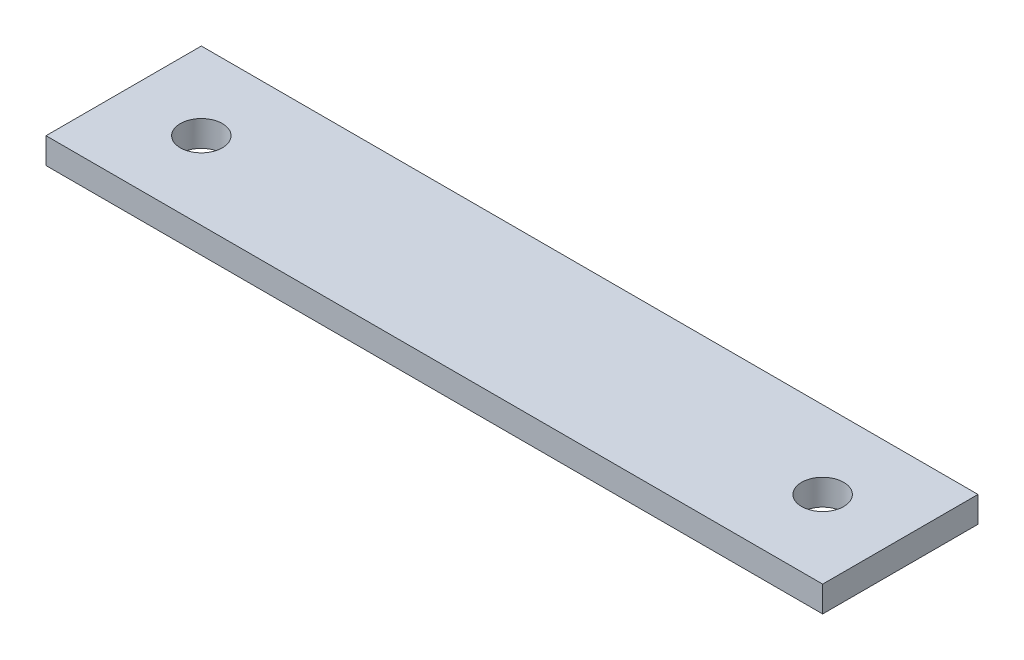
ISO-10303-21;
HEADER;
FILE_DESCRIPTION(('STEP AP214'),'2;1');
FILE_NAME('part.step','',(''),(''),'','','');
FILE_SCHEMA(('AUTOMOTIVE_DESIGN { 1 0 10303 214 1 1 1 1 }'));
ENDSEC;
DATA;
#1=APPLICATION_CONTEXT('core data for automotive mechanical design processes');
#2=APPLICATION_PROTOCOL_DEFINITION('international standard','automotive_design',2000,#1);
#3=PRODUCT_CONTEXT('',#1,'mechanical');
#4=PRODUCT('Part','Part','',(#3));
#5=PRODUCT_RELATED_PRODUCT_CATEGORY('part','',(#4));
#6=PRODUCT_DEFINITION_FORMATION('','',#4);
#7=PRODUCT_DEFINITION_CONTEXT('part definition',#1,'design');
#8=PRODUCT_DEFINITION('design','',#6,#7);
#9=PRODUCT_DEFINITION_SHAPE('','',#8);
#10=(LENGTH_UNIT() NAMED_UNIT(*) SI_UNIT(.MILLI.,.METRE.));
#11=(NAMED_UNIT(*) PLANE_ANGLE_UNIT() SI_UNIT($,.RADIAN.));
#12=(NAMED_UNIT(*) SI_UNIT($,.STERADIAN.) SOLID_ANGLE_UNIT());
#13=UNCERTAINTY_MEASURE_WITH_UNIT(LENGTH_MEASURE(1.E-05),#10,'distance_accuracy_value','');
#14=(GEOMETRIC_REPRESENTATION_CONTEXT(3) GLOBAL_UNCERTAINTY_ASSIGNED_CONTEXT((#13)) GLOBAL_UNIT_ASSIGNED_CONTEXT((#10,
#11,#12)) REPRESENTATION_CONTEXT('',''));
#15=CARTESIAN_POINT('',(0.,0.,0.));
#16=DIRECTION('',(0.,0.,1.));
#17=DIRECTION('',(1.,0.,0.));
#18=AXIS2_PLACEMENT_3D('',#15,#16,#17);
#19=CARTESIAN_POINT('',(0.,12.7,0.));
#20=DIRECTION('',(1.,0.,0.));
#21=DIRECTION('',(0.,0.,-1.));
#22=AXIS2_PLACEMENT_3D('',#19,#20,#21);
#23=PLANE('',#22);
#24=DIRECTION('',(0.,0.,1.));
#25=VECTOR('',#24,1.);
#26=CARTESIAN_POINT('',(0.,0.,0.));
#27=LINE('',#26,#25);
#28=CARTESIAN_POINT('',(0.,0.,-76.2));
#29=VERTEX_POINT('',#28);
#30=CARTESIAN_POINT('',(0.,0.,0.));
#31=VERTEX_POINT('',#30);
#32=EDGE_CURVE('E80',#29,#31,#27,.T.);
#33=ORIENTED_EDGE('',*,*,#32,.T.);
#34=DIRECTION('',(0.,-1.,0.));
#35=VECTOR('',#34,1.);
#36=CARTESIAN_POINT('',(0.,12.7,0.));
#37=LINE('',#36,#35);
#38=CARTESIAN_POINT('',(0.,12.7,0.));
#39=VERTEX_POINT('',#38);
#40=EDGE_CURVE('E11',#39,#31,#37,.T.);
#41=ORIENTED_EDGE('',*,*,#40,.F.);
#42=DIRECTION('',(0.,0.,1.));
#43=VECTOR('',#42,1.);
#44=CARTESIAN_POINT('',(0.,12.7,0.));
#45=LINE('',#44,#43);
#46=CARTESIAN_POINT('',(0.,12.7,-76.2));
#47=VERTEX_POINT('',#46);
#48=EDGE_CURVE('E68',#47,#39,#45,.T.);
#49=ORIENTED_EDGE('',*,*,#48,.F.);
#50=DIRECTION('',(0.,-1.,0.));
#51=VECTOR('',#50,1.);
#52=CARTESIAN_POINT('',(0.,12.7,-76.2));
#53=LINE('',#52,#51);
#54=EDGE_CURVE('E76',#47,#29,#53,.T.);
#55=ORIENTED_EDGE('',*,*,#54,.T.);
#56=EDGE_LOOP('',(#33,#41,#49,#55));
#57=FACE_BOUND('',#56,.T.);
#58=ADVANCED_FACE('F17',(#57),#23,.F.);
#59=CARTESIAN_POINT('',(0.,12.7,0.));
#60=DIRECTION('',(0.,0.,-1.));
#61=DIRECTION('',(-1.,0.,0.));
#62=AXIS2_PLACEMENT_3D('',#59,#60,#61);
#63=PLANE('',#62);
#64=DIRECTION('',(1.,0.,0.));
#65=VECTOR('',#64,1.);
#66=CARTESIAN_POINT('',(0.,0.,0.));
#67=LINE('',#66,#65);
#68=CARTESIAN_POINT('',(381.,0.,0.));
#69=VERTEX_POINT('',#68);
#70=EDGE_CURVE('E72',#31,#69,#67,.T.);
#71=ORIENTED_EDGE('',*,*,#70,.T.);
#72=DIRECTION('',(0.,-1.,0.));
#73=VECTOR('',#72,1.);
#74=CARTESIAN_POINT('',(381.,12.7,0.));
#75=LINE('',#74,#73);
#76=CARTESIAN_POINT('',(381.,12.7,0.));
#77=VERTEX_POINT('',#76);
#78=EDGE_CURVE('E25',#77,#69,#75,.T.);
#79=ORIENTED_EDGE('',*,*,#78,.F.);
#80=DIRECTION('',(1.,0.,0.));
#81=VECTOR('',#80,1.);
#82=CARTESIAN_POINT('',(0.,12.7,0.));
#83=LINE('',#82,#81);
#84=EDGE_CURVE('E63',#39,#77,#83,.T.);
#85=ORIENTED_EDGE('',*,*,#84,.F.);
#86=ORIENTED_EDGE('',*,*,#40,.T.);
#87=EDGE_LOOP('',(#71,#79,#85,#86));
#88=FACE_BOUND('',#87,.T.);
#89=ADVANCED_FACE('F71',(#88),#63,.F.);
#90=CARTESIAN_POINT('',(381.,12.7,0.));
#91=DIRECTION('',(-1.,0.,0.));
#92=DIRECTION('',(0.,0.,1.));
#93=AXIS2_PLACEMENT_3D('',#90,#91,#92);
#94=PLANE('',#93);
#95=DIRECTION('',(0.,0.,-1.));
#96=VECTOR('',#95,1.);
#97=CARTESIAN_POINT('',(381.,0.,0.));
#98=LINE('',#97,#96);
#99=CARTESIAN_POINT('',(381.,0.,-76.2));
#100=VERTEX_POINT('',#99);
#101=EDGE_CURVE('E50',#69,#100,#98,.T.);
#102=ORIENTED_EDGE('',*,*,#101,.T.);
#103=DIRECTION('',(0.,-1.,0.));
#104=VECTOR('',#103,1.);
#105=CARTESIAN_POINT('',(381.,12.7,-76.2));
#106=LINE('',#105,#104);
#107=CARTESIAN_POINT('',(381.,12.7,-76.2));
#108=VERTEX_POINT('',#107);
#109=EDGE_CURVE('E73',#108,#100,#106,.T.);
#110=ORIENTED_EDGE('',*,*,#109,.F.);
#111=DIRECTION('',(0.,0.,-1.));
#112=VECTOR('',#111,1.);
#113=CARTESIAN_POINT('',(381.,12.7,0.));
#114=LINE('',#113,#112);
#115=EDGE_CURVE('E66',#77,#108,#114,.T.);
#116=ORIENTED_EDGE('',*,*,#115,.F.);
#117=ORIENTED_EDGE('',*,*,#78,.T.);
#118=EDGE_LOOP('',(#102,#110,#116,#117));
#119=FACE_BOUND('',#118,.T.);
#120=ADVANCED_FACE('F74',(#119),#94,.F.);
#121=CARTESIAN_POINT('',(0.,12.7,-76.2));
#122=DIRECTION('',(0.,0.,1.));
#123=DIRECTION('',(1.,0.,0.));
#124=AXIS2_PLACEMENT_3D('',#121,#122,#123);
#125=PLANE('',#124);
#126=DIRECTION('',(-1.,0.,0.));
#127=VECTOR('',#126,1.);
#128=CARTESIAN_POINT('',(0.,0.,-76.2));
#129=LINE('',#128,#127);
#130=EDGE_CURVE('E56',#100,#29,#129,.T.);
#131=ORIENTED_EDGE('',*,*,#130,.T.);
#132=ORIENTED_EDGE('',*,*,#54,.F.);
#133=DIRECTION('',(-1.,0.,0.));
#134=VECTOR('',#133,1.);
#135=CARTESIAN_POINT('',(0.,12.7,-76.2));
#136=LINE('',#135,#134);
#137=EDGE_CURVE('E33',#108,#47,#136,.T.);
#138=ORIENTED_EDGE('',*,*,#137,.F.);
#139=ORIENTED_EDGE('',*,*,#109,.T.);
#140=EDGE_LOOP('',(#131,#132,#138,#139));
#141=FACE_BOUND('',#140,.T.);
#142=ADVANCED_FACE('F88',(#141),#125,.F.);
#143=CARTESIAN_POINT('',(0.,12.7,-76.2));
#144=DIRECTION('',(0.,-1.,0.));
#145=DIRECTION('',(0.,0.,-1.));
#146=AXIS2_PLACEMENT_3D('',#143,#144,#145);
#147=PLANE('',#146);
#148=CARTESIAN_POINT('',(342.9,12.7,-38.1));
#149=DIRECTION('',(0.,1.,0.));
#150=DIRECTION('',(0.,0.,-1.));
#151=AXIS2_PLACEMENT_3D('',#148,#149,#150);
#152=CIRCLE('',#151,10.31875);
#153=CARTESIAN_POINT('',(342.9,12.7,-48.41875));
#154=VERTEX_POINT('',#153);
#155=EDGE_CURVE('E97',#154,#154,#152,.T.);
#156=ORIENTED_EDGE('',*,*,#155,.F.);
#157=EDGE_LOOP('',(#156));
#158=FACE_BOUND('',#157,.T.);
#159=CARTESIAN_POINT('',(38.1,12.7,-38.1));
#160=DIRECTION('',(0.,1.,0.));
#161=DIRECTION('',(0.,0.,1.));
#162=AXIS2_PLACEMENT_3D('',#159,#160,#161);
#163=CIRCLE('',#162,10.31875);
#164=CARTESIAN_POINT('',(38.1,12.7,-27.78125));
#165=VERTEX_POINT('',#164);
#166=EDGE_CURVE('E83',#165,#165,#163,.T.);
#167=ORIENTED_EDGE('',*,*,#166,.F.);
#168=EDGE_LOOP('',(#167));
#169=FACE_BOUND('',#168,.T.);
#170=ORIENTED_EDGE('',*,*,#48,.T.);
#171=ORIENTED_EDGE('',*,*,#84,.T.);
#172=ORIENTED_EDGE('',*,*,#115,.T.);
#173=ORIENTED_EDGE('',*,*,#137,.T.);
#174=EDGE_LOOP('',(#170,#171,#172,#173));
#175=FACE_BOUND('',#174,.T.);
#176=ADVANCED_FACE('F64',(#158,#169,#175),#147,.F.);
#177=CARTESIAN_POINT('',(0.,0.,-76.2));
#178=DIRECTION('',(0.,-1.,0.));
#179=DIRECTION('',(0.,0.,-1.));
#180=AXIS2_PLACEMENT_3D('',#177,#178,#179);
#181=PLANE('',#180);
#182=CARTESIAN_POINT('',(342.9,0.,-38.1));
#183=DIRECTION('',(0.,-1.,0.));
#184=DIRECTION('',(0.,0.,-1.));
#185=AXIS2_PLACEMENT_3D('',#182,#183,#184);
#186=CIRCLE('',#185,10.31875);
#187=CARTESIAN_POINT('',(342.9,0.,-48.41875));
#188=VERTEX_POINT('',#187);
#189=EDGE_CURVE('E100',#188,#188,#186,.F.);
#190=ORIENTED_EDGE('',*,*,#189,.T.);
#191=EDGE_LOOP('',(#190));
#192=FACE_BOUND('',#191,.T.);
#193=CARTESIAN_POINT('',(38.1,0.,-38.1));
#194=DIRECTION('',(0.,-1.,0.));
#195=DIRECTION('',(0.,0.,-1.));
#196=AXIS2_PLACEMENT_3D('',#193,#194,#195);
#197=CIRCLE('',#196,10.31875);
#198=CARTESIAN_POINT('',(38.1,0.,-48.41875));
#199=VERTEX_POINT('',#198);
#200=EDGE_CURVE('E94',#199,#199,#197,.F.);
#201=ORIENTED_EDGE('',*,*,#200,.T.);
#202=EDGE_LOOP('',(#201));
#203=FACE_BOUND('',#202,.T.);
#204=ORIENTED_EDGE('',*,*,#32,.F.);
#205=ORIENTED_EDGE('',*,*,#130,.F.);
#206=ORIENTED_EDGE('',*,*,#101,.F.);
#207=ORIENTED_EDGE('',*,*,#70,.F.);
#208=EDGE_LOOP('',(#204,#205,#206,#207));
#209=FACE_BOUND('',#208,.T.);
#210=ADVANCED_FACE('F91',(#192,#203,#209),#181,.T.);
#211=CARTESIAN_POINT('',(38.1,-0.000999999999999265,-38.1));
#212=DIRECTION('',(0.,1.,0.));
#213=DIRECTION('',(0.,0.,1.));
#214=AXIS2_PLACEMENT_3D('',#211,#212,#213);
#215=CYLINDRICAL_SURFACE('',#214,10.31875);
#216=ORIENTED_EDGE('',*,*,#200,.F.);
#217=EDGE_LOOP('',(#216));
#218=FACE_BOUND('',#217,.T.);
#219=ORIENTED_EDGE('',*,*,#166,.T.);
#220=EDGE_LOOP('',(#219));
#221=FACE_BOUND('',#220,.T.);
#222=ADVANCED_FACE('F113',(#218,#221),#215,.F.);
#223=CARTESIAN_POINT('',(342.9,-0.000999999999999265,-38.1));
#224=DIRECTION('',(0.,1.,0.));
#225=DIRECTION('',(0.,0.,1.));
#226=AXIS2_PLACEMENT_3D('',#223,#224,#225);
#227=CYLINDRICAL_SURFACE('',#226,10.31875);
#228=ORIENTED_EDGE('',*,*,#189,.F.);
#229=EDGE_LOOP('',(#228));
#230=FACE_BOUND('',#229,.T.);
#231=ORIENTED_EDGE('',*,*,#155,.T.);
#232=EDGE_LOOP('',(#231));
#233=FACE_BOUND('',#232,.T.);
#234=ADVANCED_FACE('F106',(#230,#233),#227,.F.);
#235=CLOSED_SHELL('',(#58,#89,#120,#142,#176,#210,#222,#234));
#236=MANIFOLD_SOLID_BREP('B1',#235);
#237=ADVANCED_BREP_SHAPE_REPRESENTATION('',(#18,#236),#14);
#238=SHAPE_DEFINITION_REPRESENTATION(#9,#237);
ENDSEC;
END-ISO-10303-21;
